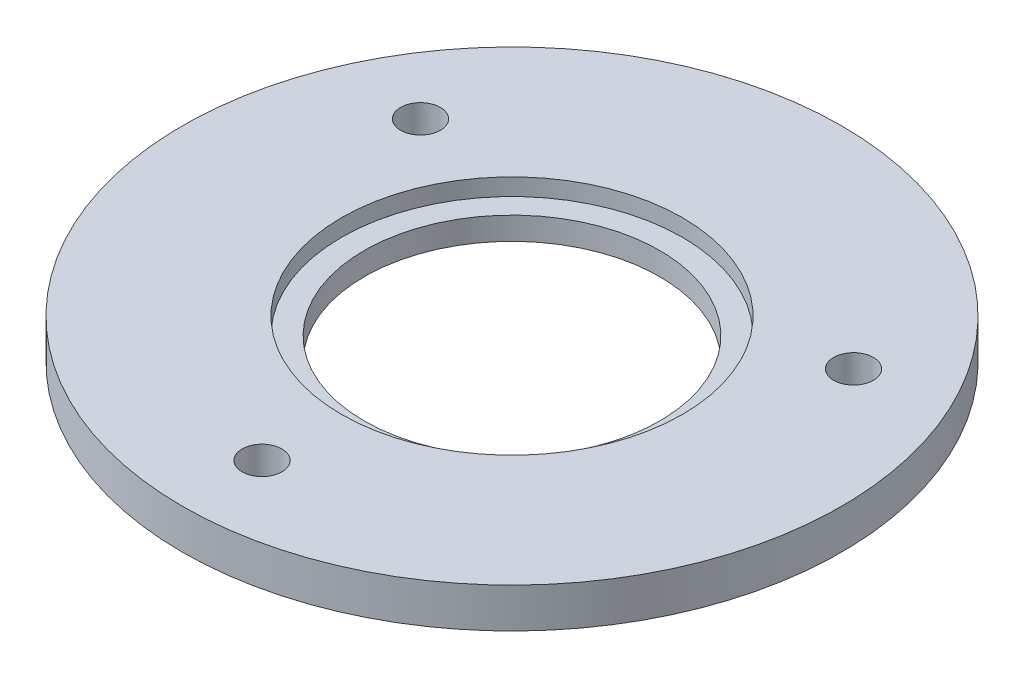
ISO-10303-21;
HEADER;
FILE_DESCRIPTION(('STEP AP214'),'2;1');
FILE_NAME('part.step','',(''),(''),'','','');
FILE_SCHEMA(('AUTOMOTIVE_DESIGN { 1 0 10303 214 1 1 1 1 }'));
ENDSEC;
DATA;
#1=APPLICATION_CONTEXT('core data for automotive mechanical design processes');
#2=APPLICATION_PROTOCOL_DEFINITION('international standard','automotive_design',2000,#1);
#3=PRODUCT_CONTEXT('',#1,'mechanical');
#4=PRODUCT('Part','Part','',(#3));
#5=PRODUCT_RELATED_PRODUCT_CATEGORY('part','',(#4));
#6=PRODUCT_DEFINITION_FORMATION('','',#4);
#7=PRODUCT_DEFINITION_CONTEXT('part definition',#1,'design');
#8=PRODUCT_DEFINITION('design','',#6,#7);
#9=PRODUCT_DEFINITION_SHAPE('','',#8);
#10=(LENGTH_UNIT() NAMED_UNIT(*) SI_UNIT(.MILLI.,.METRE.));
#11=(NAMED_UNIT(*) PLANE_ANGLE_UNIT() SI_UNIT($,.RADIAN.));
#12=(NAMED_UNIT(*) SI_UNIT($,.STERADIAN.) SOLID_ANGLE_UNIT());
#13=UNCERTAINTY_MEASURE_WITH_UNIT(LENGTH_MEASURE(1.E-05),#10,'distance_accuracy_value','');
#14=(GEOMETRIC_REPRESENTATION_CONTEXT(3) GLOBAL_UNCERTAINTY_ASSIGNED_CONTEXT((#13)) GLOBAL_UNIT_ASSIGNED_CONTEXT((#10,
#11,#12)) REPRESENTATION_CONTEXT('',''));
#15=CARTESIAN_POINT('',(0.,0.,0.));
#16=DIRECTION('',(0.,0.,1.));
#17=DIRECTION('',(1.,0.,0.));
#18=AXIS2_PLACEMENT_3D('',#15,#16,#17);
#19=CARTESIAN_POINT('',(0.,2.,0.));
#20=DIRECTION('',(0.,-1.,0.));
#21=DIRECTION('',(0.,0.,-1.));
#22=AXIS2_PLACEMENT_3D('',#19,#20,#21);
#23=CYLINDRICAL_SURFACE('',#22,13.);
#24=CARTESIAN_POINT('',(0.,2.,0.));
#25=DIRECTION('',(0.,1.,0.));
#26=DIRECTION('',(0.,0.,1.));
#27=AXIS2_PLACEMENT_3D('',#24,#25,#26);
#28=CIRCLE('',#27,13.);
#29=CARTESIAN_POINT('',(0.,2.,13.));
#30=VERTEX_POINT('',#29);
#31=EDGE_CURVE('E11',#30,#30,#28,.T.);
#32=ORIENTED_EDGE('',*,*,#31,.T.);
#33=EDGE_LOOP('',(#32));
#34=FACE_BOUND('',#33,.T.);
#35=CARTESIAN_POINT('',(0.,0.,0.));
#36=DIRECTION('',(0.,1.,0.));
#37=DIRECTION('',(0.,0.,1.));
#38=AXIS2_PLACEMENT_3D('',#35,#36,#37);
#39=CIRCLE('',#38,13.);
#40=CARTESIAN_POINT('',(0.,0.,13.));
#41=VERTEX_POINT('',#40);
#42=EDGE_CURVE('E38',#41,#41,#39,.T.);
#43=ORIENTED_EDGE('',*,*,#42,.F.);
#44=EDGE_LOOP('',(#43));
#45=FACE_BOUND('',#44,.T.);
#46=ADVANCED_FACE('F35',(#34,#45),#23,.F.);
#47=CARTESIAN_POINT('',(0.,2.,0.));
#48=DIRECTION('',(0.,1.,0.));
#49=DIRECTION('',(0.,0.,1.));
#50=AXIS2_PLACEMENT_3D('',#47,#48,#49);
#51=PLANE('',#50);
#52=ORIENTED_EDGE('',*,*,#31,.F.);
#53=EDGE_LOOP('',(#52));
#54=FACE_BOUND('',#53,.T.);
#55=CARTESIAN_POINT('',(0.,2.,0.));
#56=DIRECTION('',(0.,1.,0.));
#57=DIRECTION('',(0.,0.,1.));
#58=AXIS2_PLACEMENT_3D('',#55,#56,#57);
#59=CIRCLE('',#58,15.);
#60=CARTESIAN_POINT('',(0.,2.,15.));
#61=VERTEX_POINT('',#60);
#62=EDGE_CURVE('E45',#61,#61,#59,.F.);
#63=ORIENTED_EDGE('',*,*,#62,.F.);
#64=EDGE_LOOP('',(#63));
#65=FACE_BOUND('',#64,.T.);
#66=ADVANCED_FACE('F105',(#54,#65),#51,.T.);
#67=CARTESIAN_POINT('',(0.,0.,0.));
#68=DIRECTION('',(0.,1.,0.));
#69=DIRECTION('',(0.,0.,1.));
#70=AXIS2_PLACEMENT_3D('',#67,#68,#69);
#71=PLANE('',#70);
#72=CARTESIAN_POINT('',(-19.0525588832576,0.,-11.0000000000001));
#73=DIRECTION('',(0.,1.,0.));
#74=DIRECTION('',(0.,0.,1.));
#75=AXIS2_PLACEMENT_3D('',#72,#73,#74);
#76=CIRCLE('',#75,1.75);
#77=CARTESIAN_POINT('',(-19.0525588832576,0.,-9.25000000000009));
#78=VERTEX_POINT('',#77);
#79=EDGE_CURVE('E64',#78,#78,#76,.T.);
#80=ORIENTED_EDGE('',*,*,#79,.T.);
#81=EDGE_LOOP('',(#80));
#82=FACE_BOUND('',#81,.T.);
#83=CARTESIAN_POINT('',(19.0525588832577,0.,-10.9999999999998));
#84=DIRECTION('',(0.,1.,0.));
#85=DIRECTION('',(0.,0.,1.));
#86=AXIS2_PLACEMENT_3D('',#83,#84,#85);
#87=CIRCLE('',#86,1.75);
#88=CARTESIAN_POINT('',(19.0525588832577,0.,-9.24999999999982));
#89=VERTEX_POINT('',#88);
#90=EDGE_CURVE('E67',#89,#89,#87,.T.);
#91=ORIENTED_EDGE('',*,*,#90,.T.);
#92=EDGE_LOOP('',(#91));
#93=FACE_BOUND('',#92,.T.);
#94=CARTESIAN_POINT('',(0.,0.,22.));
#95=DIRECTION('',(0.,1.,0.));
#96=DIRECTION('',(0.,0.,1.));
#97=AXIS2_PLACEMENT_3D('',#94,#95,#96);
#98=CIRCLE('',#97,1.75);
#99=CARTESIAN_POINT('',(0.,0.,23.75));
#100=VERTEX_POINT('',#99);
#101=EDGE_CURVE('E54',#100,#100,#98,.T.);
#102=ORIENTED_EDGE('',*,*,#101,.T.);
#103=EDGE_LOOP('',(#102));
#104=FACE_BOUND('',#103,.T.);
#105=ORIENTED_EDGE('',*,*,#42,.T.);
#106=EDGE_LOOP('',(#105));
#107=FACE_BOUND('',#106,.T.);
#108=CARTESIAN_POINT('',(0.,0.,0.));
#109=DIRECTION('',(0.,1.,0.));
#110=DIRECTION('',(0.,0.,1.));
#111=AXIS2_PLACEMENT_3D('',#108,#109,#110);
#112=CIRCLE('',#111,29.);
#113=CARTESIAN_POINT('',(0.,0.,29.));
#114=VERTEX_POINT('',#113);
#115=EDGE_CURVE('E53',#114,#114,#112,.T.);
#116=ORIENTED_EDGE('',*,*,#115,.F.);
#117=EDGE_LOOP('',(#116));
#118=FACE_BOUND('',#117,.T.);
#119=ADVANCED_FACE('F101',(#82,#93,#104,#107,#118),#71,.F.);
#120=CARTESIAN_POINT('',(0.,87.0243866176395,0.));
#121=DIRECTION('',(0.,-1.,0.));
#122=DIRECTION('',(0.,0.,-1.));
#123=AXIS2_PLACEMENT_3D('',#120,#121,#122);
#124=CYLINDRICAL_SURFACE('',#123,15.);
#125=ORIENTED_EDGE('',*,*,#62,.T.);
#126=EDGE_LOOP('',(#125));
#127=FACE_BOUND('',#126,.T.);
#128=CARTESIAN_POINT('',(0.,3.5,0.));
#129=DIRECTION('',(0.,1.,0.));
#130=DIRECTION('',(0.,0.,1.));
#131=AXIS2_PLACEMENT_3D('',#128,#129,#130);
#132=CIRCLE('',#131,15.);
#133=CARTESIAN_POINT('',(0.,3.5,15.));
#134=VERTEX_POINT('',#133);
#135=EDGE_CURVE('E50',#134,#134,#132,.T.);
#136=ORIENTED_EDGE('',*,*,#135,.T.);
#137=EDGE_LOOP('',(#136));
#138=FACE_BOUND('',#137,.T.);
#139=ADVANCED_FACE('F95',(#127,#138),#124,.F.);
#140=CARTESIAN_POINT('',(0.,87.0243866176395,0.));
#141=DIRECTION('',(0.,-1.,0.));
#142=DIRECTION('',(0.,0.,-1.));
#143=AXIS2_PLACEMENT_3D('',#140,#141,#142);
#144=CYLINDRICAL_SURFACE('',#143,29.);
#145=ORIENTED_EDGE('',*,*,#115,.T.);
#146=EDGE_LOOP('',(#145));
#147=FACE_BOUND('',#146,.T.);
#148=CARTESIAN_POINT('',(0.,3.5,0.));
#149=DIRECTION('',(0.,1.,0.));
#150=DIRECTION('',(0.,0.,1.));
#151=AXIS2_PLACEMENT_3D('',#148,#149,#150);
#152=CIRCLE('',#151,29.);
#153=CARTESIAN_POINT('',(0.,3.5,29.));
#154=VERTEX_POINT('',#153);
#155=EDGE_CURVE('E49',#154,#154,#152,.T.);
#156=ORIENTED_EDGE('',*,*,#155,.F.);
#157=EDGE_LOOP('',(#156));
#158=FACE_BOUND('',#157,.T.);
#159=ADVANCED_FACE('F84',(#147,#158),#144,.T.);
#160=CARTESIAN_POINT('',(0.,3.5,0.));
#161=DIRECTION('',(0.,1.,0.));
#162=DIRECTION('',(0.,0.,1.));
#163=AXIS2_PLACEMENT_3D('',#160,#161,#162);
#164=PLANE('',#163);
#165=CARTESIAN_POINT('',(-19.0525588832576,3.5,-11.0000000000001));
#166=DIRECTION('',(0.,1.,0.));
#167=DIRECTION('',(-0.866025403784436,0.,-0.500000000000004));
#168=AXIS2_PLACEMENT_3D('',#165,#166,#167);
#169=CIRCLE('',#168,1.75);
#170=CARTESIAN_POINT('',(-20.5681033398804,3.5,-11.8750000000001));
#171=VERTEX_POINT('',#170);
#172=EDGE_CURVE('E70',#171,#171,#169,.T.);
#173=ORIENTED_EDGE('',*,*,#172,.F.);
#174=EDGE_LOOP('',(#173));
#175=FACE_BOUND('',#174,.T.);
#176=CARTESIAN_POINT('',(19.0525588832577,3.5,-10.9999999999998));
#177=DIRECTION('',(0.,1.,0.));
#178=DIRECTION('',(0.866025403784443,0.,-0.499999999999992));
#179=AXIS2_PLACEMENT_3D('',#176,#177,#178);
#180=CIRCLE('',#179,1.75);
#181=CARTESIAN_POINT('',(20.5681033398805,3.5,-11.8749999999998));
#182=VERTEX_POINT('',#181);
#183=EDGE_CURVE('E71',#182,#182,#180,.T.);
#184=ORIENTED_EDGE('',*,*,#183,.F.);
#185=EDGE_LOOP('',(#184));
#186=FACE_BOUND('',#185,.T.);
#187=CARTESIAN_POINT('',(0.,3.5,22.));
#188=DIRECTION('',(0.,1.,0.));
#189=DIRECTION('',(0.,0.,1.));
#190=AXIS2_PLACEMENT_3D('',#187,#188,#189);
#191=CIRCLE('',#190,1.75);
#192=CARTESIAN_POINT('',(0.,3.5,23.75));
#193=VERTEX_POINT('',#192);
#194=EDGE_CURVE('E61',#193,#193,#191,.T.);
#195=ORIENTED_EDGE('',*,*,#194,.F.);
#196=EDGE_LOOP('',(#195));
#197=FACE_BOUND('',#196,.T.);
#198=ORIENTED_EDGE('',*,*,#135,.F.);
#199=EDGE_LOOP('',(#198));
#200=FACE_BOUND('',#199,.T.);
#201=ORIENTED_EDGE('',*,*,#155,.T.);
#202=EDGE_LOOP('',(#201));
#203=FACE_BOUND('',#202,.T.);
#204=ADVANCED_FACE('F80',(#175,#186,#197,#200,#203),#164,.T.);
#205=CARTESIAN_POINT('',(0.,-1.,22.));
#206=DIRECTION('',(0.,1.,0.));
#207=DIRECTION('',(0.,0.,1.));
#208=AXIS2_PLACEMENT_3D('',#205,#206,#207);
#209=CYLINDRICAL_SURFACE('',#208,1.75);
#210=ORIENTED_EDGE('',*,*,#194,.T.);
#211=EDGE_LOOP('',(#210));
#212=FACE_BOUND('',#211,.T.);
#213=ORIENTED_EDGE('',*,*,#101,.F.);
#214=EDGE_LOOP('',(#213));
#215=FACE_BOUND('',#214,.T.);
#216=ADVANCED_FACE('F83',(#212,#215),#209,.F.);
#217=CARTESIAN_POINT('',(19.0525588832577,-1.,-10.9999999999998));
#218=DIRECTION('',(0.,1.,0.));
#219=DIRECTION('',(0.,0.,1.));
#220=AXIS2_PLACEMENT_3D('',#217,#218,#219);
#221=CYLINDRICAL_SURFACE('',#220,1.75);
#222=ORIENTED_EDGE('',*,*,#183,.T.);
#223=EDGE_LOOP('',(#222));
#224=FACE_BOUND('',#223,.T.);
#225=ORIENTED_EDGE('',*,*,#90,.F.);
#226=EDGE_LOOP('',(#225));
#227=FACE_BOUND('',#226,.T.);
#228=ADVANCED_FACE('F127',(#224,#227),#221,.F.);
#229=CARTESIAN_POINT('',(-19.0525588832576,-1.,-11.0000000000001));
#230=DIRECTION('',(0.,1.,0.));
#231=DIRECTION('',(0.,0.,1.));
#232=AXIS2_PLACEMENT_3D('',#229,#230,#231);
#233=CYLINDRICAL_SURFACE('',#232,1.75);
#234=ORIENTED_EDGE('',*,*,#172,.T.);
#235=EDGE_LOOP('',(#234));
#236=FACE_BOUND('',#235,.T.);
#237=ORIENTED_EDGE('',*,*,#79,.F.);
#238=EDGE_LOOP('',(#237));
#239=FACE_BOUND('',#238,.T.);
#240=ADVANCED_FACE('F77',(#236,#239),#233,.F.);
#241=CLOSED_SHELL('',(#46,#66,#119,#139,#159,#204,#216,#228,#240));
#242=MANIFOLD_SOLID_BREP('B2',#241);
#243=ADVANCED_BREP_SHAPE_REPRESENTATION('',(#18,#242),#14);
#244=SHAPE_DEFINITION_REPRESENTATION(#9,#243);
ENDSEC;
END-ISO-10303-21;
